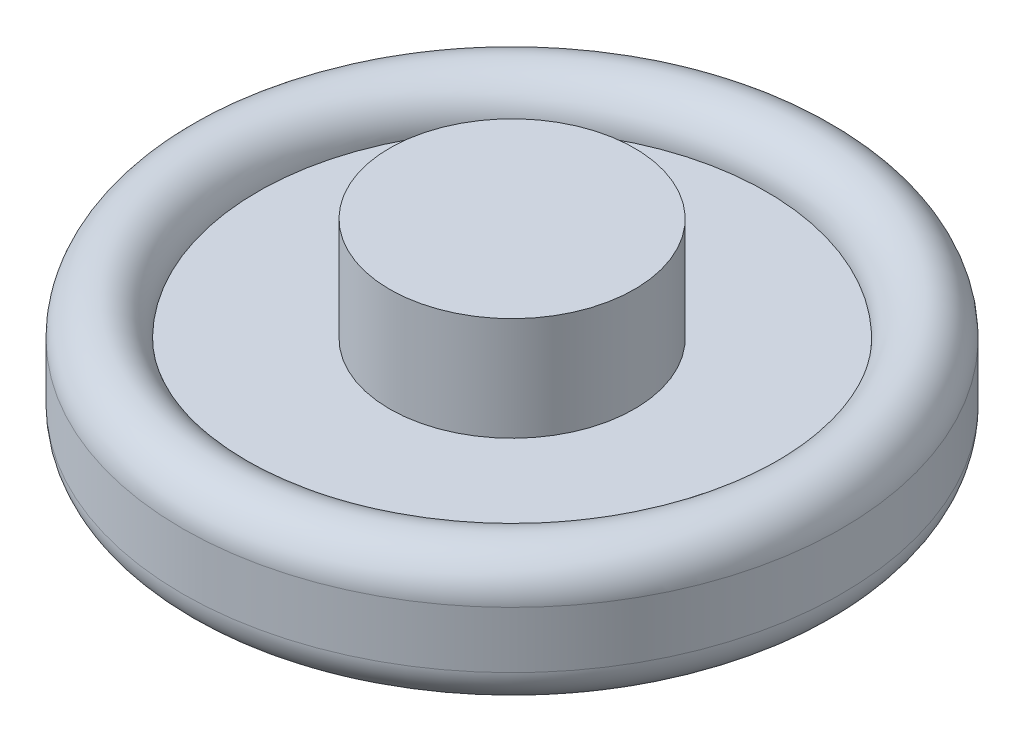
ISO-10303-21;
HEADER;
FILE_DESCRIPTION(('STEP AP214'),'2;1');
FILE_NAME('part.step','',(''),(''),'','','');
FILE_SCHEMA(('AUTOMOTIVE_DESIGN { 1 0 10303 214 1 1 1 1 }'));
ENDSEC;
DATA;
#1=APPLICATION_CONTEXT('core data for automotive mechanical design processes');
#2=APPLICATION_PROTOCOL_DEFINITION('international standard','automotive_design',2000,#1);
#3=PRODUCT_CONTEXT('',#1,'mechanical');
#4=PRODUCT('Part','Part','',(#3));
#5=PRODUCT_RELATED_PRODUCT_CATEGORY('part','',(#4));
#6=PRODUCT_DEFINITION_FORMATION('','',#4);
#7=PRODUCT_DEFINITION_CONTEXT('part definition',#1,'design');
#8=PRODUCT_DEFINITION('design','',#6,#7);
#9=PRODUCT_DEFINITION_SHAPE('','',#8);
#10=(LENGTH_UNIT() NAMED_UNIT(*) SI_UNIT(.MILLI.,.METRE.));
#11=(NAMED_UNIT(*) PLANE_ANGLE_UNIT() SI_UNIT($,.RADIAN.));
#12=(NAMED_UNIT(*) SI_UNIT($,.STERADIAN.) SOLID_ANGLE_UNIT());
#13=UNCERTAINTY_MEASURE_WITH_UNIT(LENGTH_MEASURE(1.E-05),#10,'distance_accuracy_value','');
#14=(GEOMETRIC_REPRESENTATION_CONTEXT(3) GLOBAL_UNCERTAINTY_ASSIGNED_CONTEXT((#13)) GLOBAL_UNIT_ASSIGNED_CONTEXT((#10,
#11,#12)) REPRESENTATION_CONTEXT('',''));
#15=CARTESIAN_POINT('',(0.,0.,0.));
#16=DIRECTION('',(0.,0.,1.));
#17=DIRECTION('',(1.,0.,0.));
#18=AXIS2_PLACEMENT_3D('',#15,#16,#17);
#19=CARTESIAN_POINT('',(-4.61880215351701,-0.249999999999999,0.));
#20=DIRECTION('',(0.866025403784439,0.,0.499999999999999));
#21=DIRECTION('',(0.5,0.,-0.866025403784438));
#22=AXIS2_PLACEMENT_3D('',#19,#20,#21);
#23=PLANE('',#22);
#24=DIRECTION('',(0.5,0.,-0.866025403784438));
#25=VECTOR('',#24,1.);
#26=CARTESIAN_POINT('',(-4.61880215351701,1.25,0.));
#27=LINE('',#26,#25);
#28=CARTESIAN_POINT('',(-4.61880215351701,1.25,0.));
#29=VERTEX_POINT('',#28);
#30=CARTESIAN_POINT('',(-2.3094010767585,1.25,-4.));
#31=VERTEX_POINT('',#30);
#32=EDGE_CURVE('E263',#29,#31,#27,.T.);
#33=ORIENTED_EDGE('',*,*,#32,.F.);
#34=DIRECTION('',(0.,0.999999999999999,0.));
#35=VECTOR('',#34,1.);
#36=CARTESIAN_POINT('',(-4.61880215351701,-0.249999999999999,0.));
#37=LINE('',#36,#35);
#38=CARTESIAN_POINT('',(-4.61880215351701,-0.249999999999999,0.));
#39=VERTEX_POINT('',#38);
#40=EDGE_CURVE('E243',#39,#29,#37,.T.);
#41=ORIENTED_EDGE('',*,*,#40,.F.);
#42=DIRECTION('',(0.5,0.,-0.866025403784438));
#43=VECTOR('',#42,1.);
#44=CARTESIAN_POINT('',(-4.61880215351701,-0.249999999999999,0.));
#45=LINE('',#44,#43);
#46=CARTESIAN_POINT('',(-2.3094010767585,-0.249999999999999,-4.));
#47=VERTEX_POINT('',#46);
#48=EDGE_CURVE('E250',#39,#47,#45,.T.);
#49=ORIENTED_EDGE('',*,*,#48,.T.);
#50=DIRECTION('',(0.,0.999999999999999,0.));
#51=VECTOR('',#50,1.);
#52=CARTESIAN_POINT('',(-2.3094010767585,-0.249999999999999,-4.));
#53=LINE('',#52,#51);
#54=EDGE_CURVE('E133',#47,#31,#53,.T.);
#55=ORIENTED_EDGE('',*,*,#54,.T.);
#56=EDGE_LOOP('',(#33,#41,#49,#55));
#57=FACE_BOUND('',#56,.T.);
#58=ADVANCED_FACE('F39',(#57),#23,.T.);
#59=CARTESIAN_POINT('',(-2.3094010767585,-0.249999999999999,-4.));
#60=DIRECTION('',(0.,0.,0.999999999999999));
#61=DIRECTION('',(1.,0.,0.));
#62=AXIS2_PLACEMENT_3D('',#59,#60,#61);
#63=PLANE('',#62);
#64=DIRECTION('',(1.,0.,0.));
#65=VECTOR('',#64,1.);
#66=CARTESIAN_POINT('',(-2.3094010767585,1.25,-4.));
#67=LINE('',#66,#65);
#68=CARTESIAN_POINT('',(2.30940107675851,1.25,-4.));
#69=VERTEX_POINT('',#68);
#70=EDGE_CURVE('E260',#31,#69,#67,.T.);
#71=ORIENTED_EDGE('',*,*,#70,.F.);
#72=ORIENTED_EDGE('',*,*,#54,.F.);
#73=DIRECTION('',(1.,0.,0.));
#74=VECTOR('',#73,1.);
#75=CARTESIAN_POINT('',(-2.3094010767585,-0.249999999999999,-4.));
#76=LINE('',#75,#74);
#77=CARTESIAN_POINT('',(2.30940107675851,-0.249999999999999,-4.));
#78=VERTEX_POINT('',#77);
#79=EDGE_CURVE('E278',#47,#78,#76,.T.);
#80=ORIENTED_EDGE('',*,*,#79,.T.);
#81=DIRECTION('',(0.,0.999999999999999,0.));
#82=VECTOR('',#81,1.);
#83=CARTESIAN_POINT('',(2.30940107675851,-0.249999999999999,-4.));
#84=LINE('',#83,#82);
#85=EDGE_CURVE('E231',#78,#69,#84,.T.);
#86=ORIENTED_EDGE('',*,*,#85,.T.);
#87=EDGE_LOOP('',(#71,#72,#80,#86));
#88=FACE_BOUND('',#87,.T.);
#89=ADVANCED_FACE('F180',(#88),#63,.T.);
#90=CARTESIAN_POINT('',(2.30940107675851,-0.249999999999999,-4.));
#91=DIRECTION('',(-0.866025403784439,0.,0.5));
#92=DIRECTION('',(0.5,0.,0.866025403784438));
#93=AXIS2_PLACEMENT_3D('',#90,#91,#92);
#94=PLANE('',#93);
#95=DIRECTION('',(0.5,0.,0.866025403784437));
#96=VECTOR('',#95,1.);
#97=CARTESIAN_POINT('',(2.30940107675851,1.25,-4.));
#98=LINE('',#97,#96);
#99=CARTESIAN_POINT('',(4.61880215351701,1.25,0.));
#100=VERTEX_POINT('',#99);
#101=EDGE_CURVE('E257',#69,#100,#98,.T.);
#102=ORIENTED_EDGE('',*,*,#101,.F.);
#103=ORIENTED_EDGE('',*,*,#85,.F.);
#104=DIRECTION('',(0.5,0.,0.866025403784437));
#105=VECTOR('',#104,1.);
#106=CARTESIAN_POINT('',(2.30940107675851,-0.249999999999999,-4.));
#107=LINE('',#106,#105);
#108=CARTESIAN_POINT('',(4.61880215351701,-0.249999999999999,0.));
#109=VERTEX_POINT('',#108);
#110=EDGE_CURVE('E275',#78,#109,#107,.T.);
#111=ORIENTED_EDGE('',*,*,#110,.T.);
#112=DIRECTION('',(0.,0.999999999999999,0.));
#113=VECTOR('',#112,1.);
#114=CARTESIAN_POINT('',(4.61880215351701,-0.249999999999999,0.));
#115=LINE('',#114,#113);
#116=EDGE_CURVE('E234',#109,#100,#115,.T.);
#117=ORIENTED_EDGE('',*,*,#116,.T.);
#118=EDGE_LOOP('',(#102,#103,#111,#117));
#119=FACE_BOUND('',#118,.T.);
#120=ADVANCED_FACE('F186',(#119),#94,.T.);
#121=CARTESIAN_POINT('',(4.61880215351701,-0.249999999999999,0.));
#122=DIRECTION('',(-0.866025403784439,0.,-0.499999999999999));
#123=DIRECTION('',(-0.5,0.,0.866025403784438));
#124=AXIS2_PLACEMENT_3D('',#121,#122,#123);
#125=PLANE('',#124);
#126=DIRECTION('',(-0.5,0.,0.866025403784438));
#127=VECTOR('',#126,1.);
#128=CARTESIAN_POINT('',(4.61880215351701,1.25,0.));
#129=LINE('',#128,#127);
#130=CARTESIAN_POINT('',(2.3094010767585,1.25,4.));
#131=VERTEX_POINT('',#130);
#132=EDGE_CURVE('E254',#100,#131,#129,.T.);
#133=ORIENTED_EDGE('',*,*,#132,.F.);
#134=ORIENTED_EDGE('',*,*,#116,.F.);
#135=DIRECTION('',(-0.5,0.,0.866025403784438));
#136=VECTOR('',#135,1.);
#137=CARTESIAN_POINT('',(4.61880215351701,-0.249999999999999,0.));
#138=LINE('',#137,#136);
#139=CARTESIAN_POINT('',(2.3094010767585,-0.249999999999999,4.));
#140=VERTEX_POINT('',#139);
#141=EDGE_CURVE('E272',#109,#140,#138,.T.);
#142=ORIENTED_EDGE('',*,*,#141,.T.);
#143=DIRECTION('',(0.,0.999999999999999,0.));
#144=VECTOR('',#143,1.);
#145=CARTESIAN_POINT('',(2.3094010767585,-0.249999999999999,4.));
#146=LINE('',#145,#144);
#147=EDGE_CURVE('E237',#140,#131,#146,.T.);
#148=ORIENTED_EDGE('',*,*,#147,.T.);
#149=EDGE_LOOP('',(#133,#134,#142,#148));
#150=FACE_BOUND('',#149,.T.);
#151=ADVANCED_FACE('F340',(#150),#125,.T.);
#152=CARTESIAN_POINT('',(2.3094010767585,-0.249999999999999,4.));
#153=DIRECTION('',(0.,0.,-0.999999999999999));
#154=DIRECTION('',(-1.,0.,0.));
#155=AXIS2_PLACEMENT_3D('',#152,#153,#154);
#156=PLANE('',#155);
#157=DIRECTION('',(-1.,0.,0.));
#158=VECTOR('',#157,1.);
#159=CARTESIAN_POINT('',(2.3094010767585,1.25,4.));
#160=LINE('',#159,#158);
#161=CARTESIAN_POINT('',(-2.3094010767585,1.25,4.));
#162=VERTEX_POINT('',#161);
#163=EDGE_CURVE('E251',#131,#162,#160,.T.);
#164=ORIENTED_EDGE('',*,*,#163,.F.);
#165=ORIENTED_EDGE('',*,*,#147,.F.);
#166=DIRECTION('',(-1.,0.,0.));
#167=VECTOR('',#166,1.);
#168=CARTESIAN_POINT('',(2.3094010767585,-0.249999999999999,4.));
#169=LINE('',#168,#167);
#170=CARTESIAN_POINT('',(-2.3094010767585,-0.249999999999999,4.));
#171=VERTEX_POINT('',#170);
#172=EDGE_CURVE('E269',#140,#171,#169,.T.);
#173=ORIENTED_EDGE('',*,*,#172,.T.);
#174=DIRECTION('',(0.,0.999999999999999,0.));
#175=VECTOR('',#174,1.);
#176=CARTESIAN_POINT('',(-2.3094010767585,-0.249999999999999,4.));
#177=LINE('',#176,#175);
#178=EDGE_CURVE('E240',#171,#162,#177,.T.);
#179=ORIENTED_EDGE('',*,*,#178,.T.);
#180=EDGE_LOOP('',(#164,#165,#173,#179));
#181=FACE_BOUND('',#180,.T.);
#182=ADVANCED_FACE('F342',(#181),#156,.T.);
#183=CARTESIAN_POINT('',(-2.3094010767585,-0.249999999999999,4.));
#184=DIRECTION('',(0.866025403784439,0.,-0.5));
#185=DIRECTION('',(-0.5,0.,-0.866025403784438));
#186=AXIS2_PLACEMENT_3D('',#183,#184,#185);
#187=PLANE('',#186);
#188=DIRECTION('',(-0.5,0.,-0.866025403784438));
#189=VECTOR('',#188,1.);
#190=CARTESIAN_POINT('',(-2.3094010767585,1.25,4.));
#191=LINE('',#190,#189);
#192=EDGE_CURVE('E247',#162,#29,#191,.T.);
#193=ORIENTED_EDGE('',*,*,#192,.F.);
#194=ORIENTED_EDGE('',*,*,#178,.F.);
#195=DIRECTION('',(-0.5,0.,-0.866025403784438));
#196=VECTOR('',#195,1.);
#197=CARTESIAN_POINT('',(-2.3094010767585,-0.249999999999999,4.));
#198=LINE('',#197,#196);
#199=EDGE_CURVE('E246',#171,#39,#198,.T.);
#200=ORIENTED_EDGE('',*,*,#199,.T.);
#201=ORIENTED_EDGE('',*,*,#40,.T.);
#202=EDGE_LOOP('',(#193,#194,#200,#201));
#203=FACE_BOUND('',#202,.T.);
#204=ADVANCED_FACE('F345',(#203),#187,.T.);
#205=CARTESIAN_POINT('',(0.,-0.249999999999999,0.));
#206=DIRECTION('',(0.,-0.999999999999999,0.));
#207=DIRECTION('',(0.,0.,-0.999999999999999));
#208=AXIS2_PLACEMENT_3D('',#205,#206,#207);
#209=PLANE('',#208);
#210=CARTESIAN_POINT('',(0.,-0.25,0.));
#211=DIRECTION('',(0.,-0.999999999999999,0.));
#212=DIRECTION('',(0.,0.,-0.999999999999999));
#213=AXIS2_PLACEMENT_3D('',#210,#211,#212);
#214=CIRCLE('',#213,3.);
#215=CARTESIAN_POINT('',(0.,-0.25,-3.));
#216=VERTEX_POINT('',#215);
#217=EDGE_CURVE('E285',#216,#216,#214,.T.);
#218=ORIENTED_EDGE('',*,*,#217,.T.);
#219=EDGE_LOOP('',(#218));
#220=FACE_BOUND('',#219,.T.);
#221=ORIENTED_EDGE('',*,*,#48,.F.);
#222=ORIENTED_EDGE('',*,*,#199,.F.);
#223=ORIENTED_EDGE('',*,*,#172,.F.);
#224=ORIENTED_EDGE('',*,*,#141,.F.);
#225=ORIENTED_EDGE('',*,*,#110,.F.);
#226=ORIENTED_EDGE('',*,*,#79,.F.);
#227=EDGE_LOOP('',(#221,#222,#223,#224,#225,#226));
#228=FACE_BOUND('',#227,.T.);
#229=ADVANCED_FACE('F299',(#220,#228),#209,.F.);
#230=CARTESIAN_POINT('',(0.,1.25,0.));
#231=DIRECTION('',(0.,-0.999999999999999,0.));
#232=DIRECTION('',(0.,0.,-0.999999999999999));
#233=AXIS2_PLACEMENT_3D('',#230,#231,#232);
#234=PLANE('',#233);
#235=CARTESIAN_POINT('',(0.,1.25,0.));
#236=DIRECTION('',(0.,-0.999999999999999,0.));
#237=DIRECTION('',(0.,0.,-0.999999999999999));
#238=AXIS2_PLACEMENT_3D('',#235,#236,#237);
#239=CIRCLE('',#238,3.);
#240=CARTESIAN_POINT('',(0.,1.25,-3.));
#241=VERTEX_POINT('',#240);
#242=EDGE_CURVE('E43',#241,#241,#239,.T.);
#243=ORIENTED_EDGE('',*,*,#242,.F.);
#244=EDGE_LOOP('',(#243));
#245=FACE_BOUND('',#244,.T.);
#246=ORIENTED_EDGE('',*,*,#32,.T.);
#247=ORIENTED_EDGE('',*,*,#70,.T.);
#248=ORIENTED_EDGE('',*,*,#101,.T.);
#249=ORIENTED_EDGE('',*,*,#132,.T.);
#250=ORIENTED_EDGE('',*,*,#163,.T.);
#251=ORIENTED_EDGE('',*,*,#192,.T.);
#252=EDGE_LOOP('',(#246,#247,#248,#249,#250,#251));
#253=FACE_BOUND('',#252,.T.);
#254=ADVANCED_FACE('F296',(#245,#253),#234,.T.);
#255=CARTESIAN_POINT('',(0.,13.2352813742386,0.));
#256=DIRECTION('',(0.,-0.999999999999999,0.));
#257=DIRECTION('',(0.,0.,-0.999999999999999));
#258=AXIS2_PLACEMENT_3D('',#255,#256,#257);
#259=CYLINDRICAL_SURFACE('',#258,3.);
#260=ORIENTED_EDGE('',*,*,#242,.T.);
#261=EDGE_LOOP('',(#260));
#262=FACE_BOUND('',#261,.T.);
#263=CARTESIAN_POINT('',(0.,3.25,0.));
#264=DIRECTION('',(0.,-0.999999999999999,0.));
#265=DIRECTION('',(0.,0.,-0.999999999999999));
#266=AXIS2_PLACEMENT_3D('',#263,#264,#265);
#267=CIRCLE('',#266,3.);
#268=CARTESIAN_POINT('',(0.,3.25,-3.));
#269=VERTEX_POINT('',#268);
#270=EDGE_CURVE('E266',#269,#269,#267,.T.);
#271=ORIENTED_EDGE('',*,*,#270,.F.);
#272=EDGE_LOOP('',(#271));
#273=FACE_BOUND('',#272,.T.);
#274=ADVANCED_FACE('F219',(#262,#273),#259,.F.);
#275=CARTESIAN_POINT('',(0.,-1.5,0.));
#276=DIRECTION('',(0.,-0.999999999999999,0.));
#277=DIRECTION('',(0.,0.,-0.999999999999999));
#278=AXIS2_PLACEMENT_3D('',#275,#276,#277);
#279=CIRCLE('',#278,3.);
#280=CARTESIAN_POINT('',(0.,-1.5,-3.));
#281=VERTEX_POINT('',#280);
#282=EDGE_CURVE('E288',#281,#281,#279,.T.);
#283=ORIENTED_EDGE('',*,*,#282,.T.);
#284=EDGE_LOOP('',(#283));
#285=FACE_BOUND('',#284,.T.);
#286=ORIENTED_EDGE('',*,*,#217,.F.);
#287=EDGE_LOOP('',(#286));
#288=FACE_BOUND('',#287,.T.);
#289=ADVANCED_FACE('F214',(#285,#288),#259,.F.);
#290=CARTESIAN_POINT('',(-4.61880215351701,3.25,0.));
#291=DIRECTION('',(0.866025403784439,0.,0.499999999999999));
#292=DIRECTION('',(0.5,0.,-0.866025403784438));
#293=AXIS2_PLACEMENT_3D('',#290,#291,#292);
#294=PLANE('',#293);
#295=DIRECTION('',(0.5,0.,-0.866025403784438));
#296=VECTOR('',#295,1.);
#297=CARTESIAN_POINT('',(-4.61880215351701,4.74999999999999,0.));
#298=LINE('',#297,#296);
#299=CARTESIAN_POINT('',(-4.61880215351701,4.74999999999999,0.));
#300=VERTEX_POINT('',#299);
#301=CARTESIAN_POINT('',(-2.3094010767585,4.74999999999999,-4.));
#302=VERTEX_POINT('',#301);
#303=EDGE_CURVE('E130',#300,#302,#298,.T.);
#304=ORIENTED_EDGE('',*,*,#303,.F.);
#305=DIRECTION('',(0.,0.999999999999999,0.));
#306=VECTOR('',#305,1.);
#307=CARTESIAN_POINT('',(-4.61880215351701,3.25,0.));
#308=LINE('',#307,#306);
#309=CARTESIAN_POINT('',(-4.61880215351701,3.25,0.));
#310=VERTEX_POINT('',#309);
#311=EDGE_CURVE('E126',#310,#300,#308,.T.);
#312=ORIENTED_EDGE('',*,*,#311,.F.);
#313=DIRECTION('',(0.5,0.,-0.866025403784438));
#314=VECTOR('',#313,1.);
#315=CARTESIAN_POINT('',(-4.61880215351701,3.25,0.));
#316=LINE('',#315,#314);
#317=CARTESIAN_POINT('',(-2.3094010767585,3.25,-4.));
#318=VERTEX_POINT('',#317);
#319=EDGE_CURVE('E141',#310,#318,#316,.T.);
#320=ORIENTED_EDGE('',*,*,#319,.T.);
#321=DIRECTION('',(0.,0.999999999999999,0.));
#322=VECTOR('',#321,1.);
#323=CARTESIAN_POINT('',(-2.3094010767585,3.25,-4.));
#324=LINE('',#323,#322);
#325=EDGE_CURVE('E148',#318,#302,#324,.T.);
#326=ORIENTED_EDGE('',*,*,#325,.T.);
#327=EDGE_LOOP('',(#304,#312,#320,#326));
#328=FACE_BOUND('',#327,.T.);
#329=ADVANCED_FACE('F211',(#328),#294,.T.);
#330=CARTESIAN_POINT('',(-2.3094010767585,3.25,-4.));
#331=DIRECTION('',(0.,0.,0.999999999999999));
#332=DIRECTION('',(1.,0.,0.));
#333=AXIS2_PLACEMENT_3D('',#330,#331,#332);
#334=PLANE('',#333);
#335=DIRECTION('',(1.,0.,0.));
#336=VECTOR('',#335,1.);
#337=CARTESIAN_POINT('',(-2.3094010767585,4.74999999999999,-4.));
#338=LINE('',#337,#336);
#339=CARTESIAN_POINT('',(2.3094010767585,4.74999999999999,-3.99999999999999));
#340=VERTEX_POINT('',#339);
#341=EDGE_CURVE('E132',#302,#340,#338,.T.);
#342=ORIENTED_EDGE('',*,*,#341,.F.);
#343=ORIENTED_EDGE('',*,*,#325,.F.);
#344=DIRECTION('',(1.,0.,0.));
#345=VECTOR('',#344,1.);
#346=CARTESIAN_POINT('',(-2.3094010767585,3.25,-4.));
#347=LINE('',#346,#345);
#348=CARTESIAN_POINT('',(2.30940107675851,3.25,-4.));
#349=VERTEX_POINT('',#348);
#350=EDGE_CURVE('E95',#318,#349,#347,.T.);
#351=ORIENTED_EDGE('',*,*,#350,.T.);
#352=DIRECTION('',(0.,0.999999999999999,0.));
#353=VECTOR('',#352,1.);
#354=CARTESIAN_POINT('',(2.30940107675851,3.25,-4.));
#355=LINE('',#354,#353);
#356=EDGE_CURVE('E145',#349,#340,#355,.T.);
#357=ORIENTED_EDGE('',*,*,#356,.T.);
#358=EDGE_LOOP('',(#342,#343,#351,#357));
#359=FACE_BOUND('',#358,.T.);
#360=ADVANCED_FACE('F208',(#359),#334,.T.);
#361=CARTESIAN_POINT('',(2.30940107675851,3.25,-4.));
#362=DIRECTION('',(-0.866025403784439,0.,0.5));
#363=DIRECTION('',(0.5,0.,0.866025403784438));
#364=AXIS2_PLACEMENT_3D('',#361,#362,#363);
#365=PLANE('',#364);
#366=DIRECTION('',(0.5,0.,0.866025403784437));
#367=VECTOR('',#366,1.);
#368=CARTESIAN_POINT('',(2.3094010767585,4.74999999999999,-3.99999999999999));
#369=LINE('',#368,#367);
#370=CARTESIAN_POINT('',(4.61880215351701,4.74999999999999,0.));
#371=VERTEX_POINT('',#370);
#372=EDGE_CURVE('E135',#340,#371,#369,.T.);
#373=ORIENTED_EDGE('',*,*,#372,.F.);
#374=ORIENTED_EDGE('',*,*,#356,.F.);
#375=DIRECTION('',(0.5,0.,0.866025403784437));
#376=VECTOR('',#375,1.);
#377=CARTESIAN_POINT('',(2.30940107675851,3.25,-4.));
#378=LINE('',#377,#376);
#379=CARTESIAN_POINT('',(4.61880215351701,3.25,0.));
#380=VERTEX_POINT('',#379);
#381=EDGE_CURVE('E118',#349,#380,#378,.T.);
#382=ORIENTED_EDGE('',*,*,#381,.T.);
#383=DIRECTION('',(0.,0.999999999999999,0.));
#384=VECTOR('',#383,1.);
#385=CARTESIAN_POINT('',(4.61880215351701,3.25,0.));
#386=LINE('',#385,#384);
#387=EDGE_CURVE('E115',#380,#371,#386,.T.);
#388=ORIENTED_EDGE('',*,*,#387,.T.);
#389=EDGE_LOOP('',(#373,#374,#382,#388));
#390=FACE_BOUND('',#389,.T.);
#391=ADVANCED_FACE('F205',(#390),#365,.T.);
#392=CARTESIAN_POINT('',(4.61880215351701,3.25,0.));
#393=DIRECTION('',(-0.866025403784439,0.,-0.499999999999999));
#394=DIRECTION('',(-0.5,0.,0.866025403784438));
#395=AXIS2_PLACEMENT_3D('',#392,#393,#394);
#396=PLANE('',#395);
#397=DIRECTION('',(-0.5,0.,0.866025403784438));
#398=VECTOR('',#397,1.);
#399=CARTESIAN_POINT('',(4.61880215351701,4.74999999999999,0.));
#400=LINE('',#399,#398);
#401=CARTESIAN_POINT('',(2.3094010767585,4.74999999999999,4.));
#402=VERTEX_POINT('',#401);
#403=EDGE_CURVE('E137',#371,#402,#400,.T.);
#404=ORIENTED_EDGE('',*,*,#403,.F.);
#405=ORIENTED_EDGE('',*,*,#387,.F.);
#406=DIRECTION('',(-0.5,0.,0.866025403784438));
#407=VECTOR('',#406,1.);
#408=CARTESIAN_POINT('',(4.61880215351701,3.25,0.));
#409=LINE('',#408,#407);
#410=CARTESIAN_POINT('',(2.3094010767585,3.25,4.));
#411=VERTEX_POINT('',#410);
#412=EDGE_CURVE('E109',#380,#411,#409,.T.);
#413=ORIENTED_EDGE('',*,*,#412,.T.);
#414=DIRECTION('',(0.,0.999999999999999,0.));
#415=VECTOR('',#414,1.);
#416=CARTESIAN_POINT('',(2.3094010767585,3.25,4.));
#417=LINE('',#416,#415);
#418=EDGE_CURVE('E113',#411,#402,#417,.T.);
#419=ORIENTED_EDGE('',*,*,#418,.T.);
#420=EDGE_LOOP('',(#404,#405,#413,#419));
#421=FACE_BOUND('',#420,.T.);
#422=ADVANCED_FACE('F112',(#421),#396,.T.);
#423=CARTESIAN_POINT('',(2.3094010767585,3.25,4.));
#424=DIRECTION('',(0.,0.,-0.999999999999999));
#425=DIRECTION('',(-1.,0.,0.));
#426=AXIS2_PLACEMENT_3D('',#423,#424,#425);
#427=PLANE('',#426);
#428=DIRECTION('',(-1.,0.,0.));
#429=VECTOR('',#428,1.);
#430=CARTESIAN_POINT('',(2.3094010767585,4.74999999999999,4.));
#431=LINE('',#430,#429);
#432=CARTESIAN_POINT('',(-2.30940107675851,4.75,4.));
#433=VERTEX_POINT('',#432);
#434=EDGE_CURVE('E82',#402,#433,#431,.T.);
#435=ORIENTED_EDGE('',*,*,#434,.F.);
#436=ORIENTED_EDGE('',*,*,#418,.F.);
#437=DIRECTION('',(-1.,0.,0.));
#438=VECTOR('',#437,1.);
#439=CARTESIAN_POINT('',(2.3094010767585,3.25,4.));
#440=LINE('',#439,#438);
#441=CARTESIAN_POINT('',(-2.3094010767585,3.25,4.));
#442=VERTEX_POINT('',#441);
#443=EDGE_CURVE('E117',#411,#442,#440,.T.);
#444=ORIENTED_EDGE('',*,*,#443,.T.);
#445=DIRECTION('',(0.,0.999999999999999,0.));
#446=VECTOR('',#445,1.);
#447=CARTESIAN_POINT('',(-2.3094010767585,3.25,4.));
#448=LINE('',#447,#446);
#449=EDGE_CURVE('E122',#442,#433,#448,.T.);
#450=ORIENTED_EDGE('',*,*,#449,.T.);
#451=EDGE_LOOP('',(#435,#436,#444,#450));
#452=FACE_BOUND('',#451,.T.);
#453=ADVANCED_FACE('F121',(#452),#427,.T.);
#454=CARTESIAN_POINT('',(-2.3094010767585,3.25,4.));
#455=DIRECTION('',(0.866025403784439,0.,-0.5));
#456=DIRECTION('',(-0.5,0.,-0.866025403784438));
#457=AXIS2_PLACEMENT_3D('',#454,#455,#456);
#458=PLANE('',#457);
#459=DIRECTION('',(-0.5,0.,-0.866025403784438));
#460=VECTOR('',#459,1.);
#461=CARTESIAN_POINT('',(-2.30940107675851,4.75,4.));
#462=LINE('',#461,#460);
#463=EDGE_CURVE('E87',#433,#300,#462,.T.);
#464=ORIENTED_EDGE('',*,*,#463,.F.);
#465=ORIENTED_EDGE('',*,*,#449,.F.);
#466=DIRECTION('',(-0.5,0.,-0.866025403784438));
#467=VECTOR('',#466,1.);
#468=CARTESIAN_POINT('',(-2.3094010767585,3.25,4.));
#469=LINE('',#468,#467);
#470=EDGE_CURVE('E58',#442,#310,#469,.T.);
#471=ORIENTED_EDGE('',*,*,#470,.T.);
#472=ORIENTED_EDGE('',*,*,#311,.T.);
#473=EDGE_LOOP('',(#464,#465,#471,#472));
#474=FACE_BOUND('',#473,.T.);
#475=ADVANCED_FACE('F195',(#474),#458,.T.);
#476=CARTESIAN_POINT('',(0.,3.25,0.));
#477=DIRECTION('',(0.,-0.999999999999999,0.));
#478=DIRECTION('',(0.,0.,-0.999999999999999));
#479=AXIS2_PLACEMENT_3D('',#476,#477,#478);
#480=PLANE('',#479);
#481=ORIENTED_EDGE('',*,*,#270,.T.);
#482=EDGE_LOOP('',(#481));
#483=FACE_BOUND('',#482,.T.);
#484=ORIENTED_EDGE('',*,*,#319,.F.);
#485=ORIENTED_EDGE('',*,*,#470,.F.);
#486=ORIENTED_EDGE('',*,*,#443,.F.);
#487=ORIENTED_EDGE('',*,*,#412,.F.);
#488=ORIENTED_EDGE('',*,*,#381,.F.);
#489=ORIENTED_EDGE('',*,*,#350,.F.);
#490=EDGE_LOOP('',(#484,#485,#486,#487,#488,#489));
#491=FACE_BOUND('',#490,.T.);
#492=ADVANCED_FACE('F124',(#483,#491),#480,.F.);
#493=CARTESIAN_POINT('',(0.,4.74999999999999,0.));
#494=DIRECTION('',(0.,-0.999999999999999,0.));
#495=DIRECTION('',(0.,0.,-0.999999999999999));
#496=AXIS2_PLACEMENT_3D('',#493,#494,#495);
#497=PLANE('',#496);
#498=ORIENTED_EDGE('',*,*,#303,.T.);
#499=ORIENTED_EDGE('',*,*,#341,.T.);
#500=ORIENTED_EDGE('',*,*,#372,.T.);
#501=ORIENTED_EDGE('',*,*,#403,.T.);
#502=ORIENTED_EDGE('',*,*,#434,.T.);
#503=ORIENTED_EDGE('',*,*,#463,.T.);
#504=EDGE_LOOP('',(#498,#499,#500,#501,#502,#503));
#505=FACE_BOUND('',#504,.T.);
#506=ADVANCED_FACE('F194',(#505),#497,.T.);
#507=CARTESIAN_POINT('',(0.,1.5,0.));
#508=DIRECTION('',(0.,0.999999999999999,0.));
#509=DIRECTION('',(0.,0.,0.999999999999999));
#510=AXIS2_PLACEMENT_3D('',#507,#508,#509);
#511=PLANE('',#510);
#512=CARTESIAN_POINT('',(0.,1.5,0.));
#513=DIRECTION('',(0.,0.999999999999999,0.));
#514=DIRECTION('',(0.,0.,0.999999999999999));
#515=AXIS2_PLACEMENT_3D('',#512,#513,#514);
#516=CIRCLE('',#515,13.5);
#517=CARTESIAN_POINT('',(0.,1.5,13.5));
#518=VERTEX_POINT('',#517);
#519=EDGE_CURVE('E49',#518,#518,#516,.T.);
#520=ORIENTED_EDGE('',*,*,#519,.T.);
#521=EDGE_LOOP('',(#520));
#522=FACE_BOUND('',#521,.T.);
#523=CARTESIAN_POINT('',(0.,1.5,0.));
#524=DIRECTION('',(0.,0.999999999999999,0.));
#525=DIRECTION('',(0.,0.,0.999999999999999));
#526=AXIS2_PLACEMENT_3D('',#523,#524,#525);
#527=CIRCLE('',#526,6.5);
#528=CARTESIAN_POINT('',(0.,1.5,6.5));
#529=VERTEX_POINT('',#528);
#530=EDGE_CURVE('E154',#529,#529,#527,.F.);
#531=ORIENTED_EDGE('',*,*,#530,.T.);
#532=EDGE_LOOP('',(#531));
#533=FACE_BOUND('',#532,.T.);
#534=ADVANCED_FACE('F165',(#522,#533),#511,.T.);
#535=CARTESIAN_POINT('',(0.,0.,0.));
#536=DIRECTION('',(0.,0.999999999999999,0.));
#537=DIRECTION('',(0.,0.,0.999999999999999));
#538=AXIS2_PLACEMENT_3D('',#535,#536,#537);
#539=CYLINDRICAL_SURFACE('',#538,17.5);
#540=CARTESIAN_POINT('',(0.,1.5,0.));
#541=DIRECTION('',(0.,0.999999999999999,0.));
#542=DIRECTION('',(0.,0.,0.999999999999999));
#543=AXIS2_PLACEMENT_3D('',#540,#541,#542);
#544=CIRCLE('',#543,17.5);
#545=CARTESIAN_POINT('',(0.,1.5,17.5));
#546=VERTEX_POINT('',#545);
#547=EDGE_CURVE('E11',#546,#546,#544,.T.);
#548=ORIENTED_EDGE('',*,*,#547,.F.);
#549=EDGE_LOOP('',(#548));
#550=FACE_BOUND('',#549,.T.);
#551=CARTESIAN_POINT('',(0.,-1.5,0.));
#552=DIRECTION('',(0.,0.999999999999999,0.));
#553=DIRECTION('',(0.,0.,0.999999999999999));
#554=AXIS2_PLACEMENT_3D('',#551,#552,#553);
#555=CIRCLE('',#554,17.5);
#556=CARTESIAN_POINT('',(0.,-1.5,17.5));
#557=VERTEX_POINT('',#556);
#558=EDGE_CURVE('E155',#557,#557,#555,.T.);
#559=ORIENTED_EDGE('',*,*,#558,.T.);
#560=EDGE_LOOP('',(#559));
#561=FACE_BOUND('',#560,.T.);
#562=ADVANCED_FACE('F437',(#550,#561),#539,.T.);
#563=CARTESIAN_POINT('',(0.,-1.5,0.));
#564=DIRECTION('',(0.,0.999999999999999,0.));
#565=DIRECTION('',(0.,0.,0.999999999999999));
#566=AXIS2_PLACEMENT_3D('',#563,#564,#565);
#567=TOROIDAL_SURFACE('',#566,15.5,2.);
#568=ORIENTED_EDGE('',*,*,#558,.F.);
#569=EDGE_LOOP('',(#568));
#570=FACE_BOUND('',#569,.T.);
#571=CARTESIAN_POINT('',(0.,-1.5,0.));
#572=DIRECTION('',(0.,0.999999999999999,0.));
#573=DIRECTION('',(0.,0.,0.999999999999999));
#574=AXIS2_PLACEMENT_3D('',#571,#572,#573);
#575=CIRCLE('',#574,13.5);
#576=CARTESIAN_POINT('',(0.,-1.5,13.5));
#577=VERTEX_POINT('',#576);
#578=EDGE_CURVE('E158',#577,#577,#575,.T.);
#579=ORIENTED_EDGE('',*,*,#578,.T.);
#580=EDGE_LOOP('',(#579));
#581=FACE_BOUND('',#580,.T.);
#582=ADVANCED_FACE('F451',(#570,#581),#567,.T.);
#583=CARTESIAN_POINT('',(0.,1.5,0.));
#584=DIRECTION('',(0.,0.999999999999999,0.));
#585=DIRECTION('',(0.,0.,0.999999999999999));
#586=AXIS2_PLACEMENT_3D('',#583,#584,#585);
#587=TOROIDAL_SURFACE('',#586,15.5,2.);
#588=ORIENTED_EDGE('',*,*,#519,.F.);
#589=EDGE_LOOP('',(#588));
#590=FACE_BOUND('',#589,.T.);
#591=ORIENTED_EDGE('',*,*,#547,.T.);
#592=EDGE_LOOP('',(#591));
#593=FACE_BOUND('',#592,.T.);
#594=ADVANCED_FACE('F444',(#590,#593),#587,.T.);
#595=CARTESIAN_POINT('',(0.,-1.5,0.));
#596=DIRECTION('',(0.,0.999999999999999,0.));
#597=DIRECTION('',(0.,0.,0.999999999999999));
#598=AXIS2_PLACEMENT_3D('',#595,#596,#597);
#599=PLANE('',#598);
#600=ORIENTED_EDGE('',*,*,#282,.F.);
#601=EDGE_LOOP('',(#600));
#602=FACE_BOUND('',#601,.T.);
#603=ORIENTED_EDGE('',*,*,#578,.F.);
#604=EDGE_LOOP('',(#603));
#605=FACE_BOUND('',#604,.T.);
#606=ADVANCED_FACE('F41',(#602,#605),#599,.F.);
#607=CARTESIAN_POINT('',(0.,6.99999999999999,0.));
#608=DIRECTION('',(0.,-0.999999999999999,0.));
#609=DIRECTION('',(0.,0.,-0.999999999999999));
#610=AXIS2_PLACEMENT_3D('',#607,#608,#609);
#611=CYLINDRICAL_SURFACE('',#610,6.5);
#612=ORIENTED_EDGE('',*,*,#530,.F.);
#613=EDGE_LOOP('',(#612));
#614=FACE_BOUND('',#613,.T.);
#615=CARTESIAN_POINT('',(0.,6.99999999999999,0.));
#616=DIRECTION('',(0.,0.999999999999999,0.));
#617=DIRECTION('',(0.,0.,0.999999999999999));
#618=AXIS2_PLACEMENT_3D('',#615,#616,#617);
#619=CIRCLE('',#618,6.5);
#620=CARTESIAN_POINT('',(0.,6.99999999999999,6.5));
#621=VERTEX_POINT('',#620);
#622=EDGE_CURVE('E151',#621,#621,#619,.T.);
#623=ORIENTED_EDGE('',*,*,#622,.F.);
#624=EDGE_LOOP('',(#623));
#625=FACE_BOUND('',#624,.T.);
#626=ADVANCED_FACE('F167',(#614,#625),#611,.T.);
#627=CARTESIAN_POINT('',(0.,6.99999999999999,0.));
#628=DIRECTION('',(0.,0.999999999999999,0.));
#629=DIRECTION('',(0.,0.,0.999999999999999));
#630=AXIS2_PLACEMENT_3D('',#627,#628,#629);
#631=PLANE('',#630);
#632=ORIENTED_EDGE('',*,*,#622,.T.);
#633=EDGE_LOOP('',(#632));
#634=FACE_BOUND('',#633,.T.);
#635=ADVANCED_FACE('F170',(#634),#631,.T.);
#636=CLOSED_SHELL('',(#58,#89,#120,#151,#182,#204,#229,#254,#274,#289,#329,#360,#391,#422,#453,
#475,#492,#506,#534,#562,#582,#594,#606,#626,#635));
#637=MANIFOLD_SOLID_BREP('B2',#636);
#638=ADVANCED_BREP_SHAPE_REPRESENTATION('',(#18,#637),#14);
#639=SHAPE_DEFINITION_REPRESENTATION(#9,#638);
ENDSEC;
END-ISO-10303-21;
